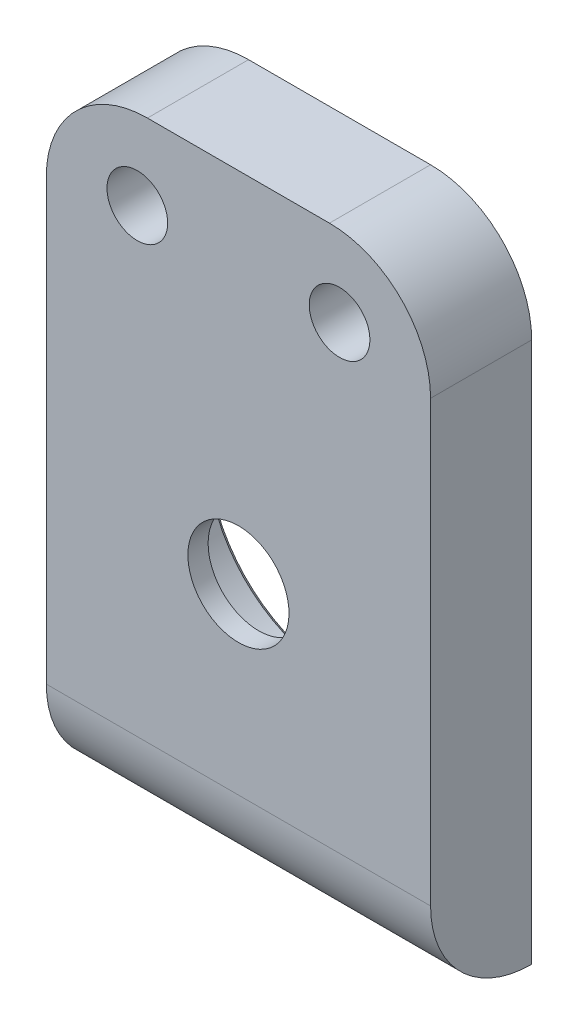
ISO-10303-21;
HEADER;
FILE_DESCRIPTION(('STEP AP214'),'2;1');
FILE_NAME('part.step','',(''),(''),'','','');
FILE_SCHEMA(('AUTOMOTIVE_DESIGN { 1 0 10303 214 1 1 1 1 }'));
ENDSEC;
DATA;
#1=APPLICATION_CONTEXT('core data for automotive mechanical design processes');
#2=APPLICATION_PROTOCOL_DEFINITION('international standard','automotive_design',2000,#1);
#3=PRODUCT_CONTEXT('',#1,'mechanical');
#4=PRODUCT('Part','Part','',(#3));
#5=PRODUCT_RELATED_PRODUCT_CATEGORY('part','',(#4));
#6=PRODUCT_DEFINITION_FORMATION('','',#4);
#7=PRODUCT_DEFINITION_CONTEXT('part definition',#1,'design');
#8=PRODUCT_DEFINITION('design','',#6,#7);
#9=PRODUCT_DEFINITION_SHAPE('','',#8);
#10=(LENGTH_UNIT() NAMED_UNIT(*) SI_UNIT(.MILLI.,.METRE.));
#11=(NAMED_UNIT(*) PLANE_ANGLE_UNIT() SI_UNIT($,.RADIAN.));
#12=(NAMED_UNIT(*) SI_UNIT($,.STERADIAN.) SOLID_ANGLE_UNIT());
#13=UNCERTAINTY_MEASURE_WITH_UNIT(LENGTH_MEASURE(1.E-05),#10,'distance_accuracy_value','');
#14=(GEOMETRIC_REPRESENTATION_CONTEXT(3) GLOBAL_UNCERTAINTY_ASSIGNED_CONTEXT((#13)) GLOBAL_UNIT_ASSIGNED_CONTEXT((#10,
#11,#12)) REPRESENTATION_CONTEXT('',''));
#15=CARTESIAN_POINT('',(0.,0.,0.));
#16=DIRECTION('',(0.,0.,1.));
#17=DIRECTION('',(1.,0.,0.));
#18=AXIS2_PLACEMENT_3D('',#15,#16,#17);
#19=CARTESIAN_POINT('',(0.,13.1015537091819,20.7143094769658));
#20=DIRECTION('',(0.,0.,-1.));
#21=DIRECTION('',(-1.,0.,0.));
#22=AXIS2_PLACEMENT_3D('',#19,#20,#21);
#23=CONICAL_SURFACE('',#22,6.,0.785398163397448);
#24=CARTESIAN_POINT('',(0.,13.1015537091819,20.2143094769658));
#25=DIRECTION('',(0.,0.,1.));
#26=DIRECTION('',(-1.,0.,0.));
#27=AXIS2_PLACEMENT_3D('',#24,#25,#26);
#28=CIRCLE('',#27,6.5);
#29=CARTESIAN_POINT('',(-6.5,13.1015537091819,20.2143094769658));
#30=VERTEX_POINT('',#29);
#31=EDGE_CURVE('E148',#30,#30,#28,.T.);
#32=ORIENTED_EDGE('',*,*,#31,.F.);
#33=EDGE_LOOP('',(#32));
#34=FACE_BOUND('',#33,.T.);
#35=CARTESIAN_POINT('',(0.,13.1015537091819,20.4643094769658));
#36=DIRECTION('',(0.,0.,-1.));
#37=DIRECTION('',(-1.,0.,0.));
#38=AXIS2_PLACEMENT_3D('',#35,#36,#37);
#39=CIRCLE('',#38,6.25);
#40=CARTESIAN_POINT('',(-6.25,13.1015537091819,20.4643094769658));
#41=VERTEX_POINT('',#40);
#42=EDGE_CURVE('E128',#41,#41,#39,.T.);
#43=ORIENTED_EDGE('',*,*,#42,.F.);
#44=EDGE_LOOP('',(#43));
#45=FACE_BOUND('',#44,.T.);
#46=ADVANCED_FACE('F43',(#34,#45),#23,.F.);
#47=CARTESIAN_POINT('',(9.5,7.60659887027264,25.2143094769657));
#48=DIRECTION('',(0.,0.,-1.));
#49=DIRECTION('',(-1.,0.,0.));
#50=AXIS2_PLACEMENT_3D('',#47,#48,#49);
#51=PLANE('',#50);
#52=CARTESIAN_POINT('',(-5.,26.8080822959938,25.2143094769657));
#53=DIRECTION('',(0.,0.,1.));
#54=DIRECTION('',(1.,0.,0.));
#55=AXIS2_PLACEMENT_3D('',#52,#53,#54);
#56=CIRCLE('',#55,1.5);
#57=CARTESIAN_POINT('',(-3.5,26.8080822959938,25.2143094769657));
#58=VERTEX_POINT('',#57);
#59=EDGE_CURVE('E127',#58,#58,#56,.T.);
#60=ORIENTED_EDGE('',*,*,#59,.F.);
#61=EDGE_LOOP('',(#60));
#62=FACE_BOUND('',#61,.T.);
#63=CARTESIAN_POINT('',(5.,26.8080822959938,25.2143094769657));
#64=DIRECTION('',(0.,0.,1.));
#65=DIRECTION('',(1.,0.,0.));
#66=AXIS2_PLACEMENT_3D('',#63,#64,#65);
#67=CIRCLE('',#66,1.5);
#68=CARTESIAN_POINT('',(6.5,26.8080822959938,25.2143094769657));
#69=VERTEX_POINT('',#68);
#70=EDGE_CURVE('E168',#69,#69,#67,.T.);
#71=ORIENTED_EDGE('',*,*,#70,.F.);
#72=EDGE_LOOP('',(#71));
#73=FACE_BOUND('',#72,.T.);
#74=CARTESIAN_POINT('',(0.,13.1015537091819,25.2143094769657));
#75=DIRECTION('',(0.,0.,-1.));
#76=DIRECTION('',(0.,1.,0.));
#77=AXIS2_PLACEMENT_3D('',#74,#75,#76);
#78=CIRCLE('',#77,2.5);
#79=CARTESIAN_POINT('',(0.,15.6015537091819,25.2143094769657));
#80=VERTEX_POINT('',#79);
#81=EDGE_CURVE('E116',#80,#80,#78,.T.);
#82=ORIENTED_EDGE('',*,*,#81,.T.);
#83=EDGE_LOOP('',(#82));
#84=FACE_BOUND('',#83,.T.);
#85=DIRECTION('',(0.,-1.,0.));
#86=VECTOR('',#85,1.);
#87=CARTESIAN_POINT('',(-9.5,7.60659887027264,25.2143094769657));
#88=LINE('',#87,#86);
#89=CARTESIAN_POINT('',(-9.5,25.8080822959938,25.2143094769657));
#90=VERTEX_POINT('',#89);
#91=CARTESIAN_POINT('',(-9.5,4.06933743514415,25.2143094769657));
#92=VERTEX_POINT('',#91);
#93=EDGE_CURVE('E153',#90,#92,#88,.T.);
#94=ORIENTED_EDGE('',*,*,#93,.T.);
#95=DIRECTION('',(-1.,0.,0.));
#96=VECTOR('',#95,1.);
#97=CARTESIAN_POINT('',(9.5,4.06933743514415,25.2143094769657));
#98=LINE('',#97,#96);
#99=CARTESIAN_POINT('',(9.5,4.06933743514415,25.2143094769657));
#100=VERTEX_POINT('',#99);
#101=EDGE_CURVE('E51',#92,#100,#98,.F.);
#102=ORIENTED_EDGE('',*,*,#101,.T.);
#103=DIRECTION('',(0.,-1.,0.));
#104=VECTOR('',#103,1.);
#105=CARTESIAN_POINT('',(9.5,7.60659887027264,25.2143094769657));
#106=LINE('',#105,#104);
#107=CARTESIAN_POINT('',(9.5,25.8080822959938,25.2143094769657));
#108=VERTEX_POINT('',#107);
#109=EDGE_CURVE('E158',#108,#100,#106,.T.);
#110=ORIENTED_EDGE('',*,*,#109,.F.);
#111=CARTESIAN_POINT('',(4.5,25.8080822959938,25.2143094769657));
#112=DIRECTION('',(0.,0.,1.));
#113=DIRECTION('',(0.,1.,0.));
#114=AXIS2_PLACEMENT_3D('',#111,#112,#113);
#115=CIRCLE('',#114,5.);
#116=CARTESIAN_POINT('',(4.5,30.8080822959938,25.2143094769657));
#117=VERTEX_POINT('',#116);
#118=EDGE_CURVE('E150',#108,#117,#115,.T.);
#119=ORIENTED_EDGE('',*,*,#118,.T.);
#120=DIRECTION('',(-1.,0.,0.));
#121=VECTOR('',#120,1.);
#122=CARTESIAN_POINT('',(9.5,30.8080822959938,25.2143094769657));
#123=LINE('',#122,#121);
#124=CARTESIAN_POINT('',(-4.5,30.8080822959938,25.2143094769657));
#125=VERTEX_POINT('',#124);
#126=EDGE_CURVE('E143',#117,#125,#123,.T.);
#127=ORIENTED_EDGE('',*,*,#126,.T.);
#128=CARTESIAN_POINT('',(-4.5,25.8080822959938,25.2143094769657));
#129=DIRECTION('',(0.,0.,1.));
#130=DIRECTION('',(0.,1.,0.));
#131=AXIS2_PLACEMENT_3D('',#128,#129,#130);
#132=CIRCLE('',#131,5.);
#133=EDGE_CURVE('E146',#125,#90,#132,.T.);
#134=ORIENTED_EDGE('',*,*,#133,.T.);
#135=EDGE_LOOP('',(#94,#102,#110,#119,#127,#134));
#136=FACE_BOUND('',#135,.T.);
#137=ADVANCED_FACE('F176',(#62,#73,#84,#136),#51,.F.);
#138=CARTESIAN_POINT('',(9.5,7.91732382523638,20.2143094769658));
#139=DIRECTION('',(0.,0.,-1.));
#140=DIRECTION('',(0.,-1.,0.));
#141=AXIS2_PLACEMENT_3D('',#138,#139,#140);
#142=PLANE('',#141);
#143=ORIENTED_EDGE('',*,*,#31,.T.);
#144=EDGE_LOOP('',(#143));
#145=FACE_BOUND('',#144,.T.);
#146=CARTESIAN_POINT('',(-5.,26.8080822959938,20.2143094769658));
#147=DIRECTION('',(0.,0.,-1.));
#148=DIRECTION('',(-1.,0.,0.));
#149=AXIS2_PLACEMENT_3D('',#146,#147,#148);
#150=CIRCLE('',#149,1.5);
#151=CARTESIAN_POINT('',(-6.5,26.8080822959938,20.2143094769658));
#152=VERTEX_POINT('',#151);
#153=EDGE_CURVE('E120',#152,#152,#150,.T.);
#154=ORIENTED_EDGE('',*,*,#153,.F.);
#155=EDGE_LOOP('',(#154));
#156=FACE_BOUND('',#155,.T.);
#157=CARTESIAN_POINT('',(5.,26.8080822959938,20.2143094769658));
#158=DIRECTION('',(0.,0.,-1.));
#159=DIRECTION('',(-1.,0.,0.));
#160=AXIS2_PLACEMENT_3D('',#157,#158,#159);
#161=CIRCLE('',#160,1.5);
#162=CARTESIAN_POINT('',(3.5,26.8080822959938,20.2143094769658));
#163=VERTEX_POINT('',#162);
#164=EDGE_CURVE('E124',#163,#163,#161,.T.);
#165=ORIENTED_EDGE('',*,*,#164,.F.);
#166=EDGE_LOOP('',(#165));
#167=FACE_BOUND('',#166,.T.);
#168=DIRECTION('',(0.,-1.,0.));
#169=VECTOR('',#168,1.);
#170=CARTESIAN_POINT('',(9.5,7.91732382523638,20.2143094769658));
#171=LINE('',#170,#169);
#172=CARTESIAN_POINT('',(9.5,25.8080822959938,20.2143094769658));
#173=VERTEX_POINT('',#172);
#174=CARTESIAN_POINT('',(9.5,-0.930662564855851,20.2143094769657));
#175=VERTEX_POINT('',#174);
#176=EDGE_CURVE('E113',#173,#175,#171,.T.);
#177=ORIENTED_EDGE('',*,*,#176,.T.);
#178=DIRECTION('',(-1.,0.,0.));
#179=VECTOR('',#178,1.);
#180=CARTESIAN_POINT('',(-9.5,-0.930662564855851,20.2143094769657));
#181=LINE('',#180,#179);
#182=CARTESIAN_POINT('',(-9.5,-0.930662564855851,20.2143094769658));
#183=VERTEX_POINT('',#182);
#184=EDGE_CURVE('E110',#175,#183,#181,.T.);
#185=ORIENTED_EDGE('',*,*,#184,.T.);
#186=DIRECTION('',(0.,-1.,0.));
#187=VECTOR('',#186,1.);
#188=CARTESIAN_POINT('',(-9.5,7.91732382523638,20.2143094769658));
#189=LINE('',#188,#187);
#190=CARTESIAN_POINT('',(-9.5,25.8080822959938,20.2143094769658));
#191=VERTEX_POINT('',#190);
#192=EDGE_CURVE('E99',#191,#183,#189,.T.);
#193=ORIENTED_EDGE('',*,*,#192,.F.);
#194=CARTESIAN_POINT('',(-4.5,25.8080822959938,20.2143094769658));
#195=DIRECTION('',(0.,0.,-1.));
#196=DIRECTION('',(-1.,0.,0.));
#197=AXIS2_PLACEMENT_3D('',#194,#195,#196);
#198=CIRCLE('',#197,5.);
#199=CARTESIAN_POINT('',(-4.5,30.8080822959938,20.2143094769658));
#200=VERTEX_POINT('',#199);
#201=EDGE_CURVE('E139',#191,#200,#198,.T.);
#202=ORIENTED_EDGE('',*,*,#201,.T.);
#203=DIRECTION('',(-1.,0.,0.));
#204=VECTOR('',#203,1.);
#205=CARTESIAN_POINT('',(9.5,30.8080822959938,20.2143094769658));
#206=LINE('',#205,#204);
#207=CARTESIAN_POINT('',(4.5,30.8080822959938,20.2143094769658));
#208=VERTEX_POINT('',#207);
#209=EDGE_CURVE('E134',#208,#200,#206,.T.);
#210=ORIENTED_EDGE('',*,*,#209,.F.);
#211=CARTESIAN_POINT('',(4.5,25.8080822959938,20.2143094769658));
#212=DIRECTION('',(0.,0.,-1.));
#213=DIRECTION('',(-1.,0.,0.));
#214=AXIS2_PLACEMENT_3D('',#211,#212,#213);
#215=CIRCLE('',#214,5.);
#216=EDGE_CURVE('E137',#208,#173,#215,.T.);
#217=ORIENTED_EDGE('',*,*,#216,.T.);
#218=EDGE_LOOP('',(#177,#185,#193,#202,#210,#217));
#219=FACE_BOUND('',#218,.T.);
#220=ADVANCED_FACE('F111',(#145,#156,#167,#219),#142,.T.);
#221=CARTESIAN_POINT('',(9.5,30.8080822959938,22.7143094769658));
#222=DIRECTION('',(0.,1.,0.));
#223=DIRECTION('',(1.,0.,0.));
#224=AXIS2_PLACEMENT_3D('',#221,#222,#223);
#225=PLANE('',#224);
#226=ORIENTED_EDGE('',*,*,#209,.T.);
#227=DIRECTION('',(0.,0.,1.));
#228=VECTOR('',#227,1.);
#229=CARTESIAN_POINT('',(-4.5,30.8080822959938,25.2143094769657));
#230=LINE('',#229,#228);
#231=EDGE_CURVE('E131',#200,#125,#230,.T.);
#232=ORIENTED_EDGE('',*,*,#231,.T.);
#233=ORIENTED_EDGE('',*,*,#126,.F.);
#234=DIRECTION('',(0.,0.,-1.));
#235=VECTOR('',#234,1.);
#236=CARTESIAN_POINT('',(4.5,30.8080822959938,22.7143094769658));
#237=LINE('',#236,#235);
#238=EDGE_CURVE('E135',#117,#208,#237,.T.);
#239=ORIENTED_EDGE('',*,*,#238,.T.);
#240=EDGE_LOOP('',(#226,#232,#233,#239));
#241=FACE_BOUND('',#240,.T.);
#242=ADVANCED_FACE('F192',(#241),#225,.T.);
#243=CARTESIAN_POINT('',(9.5,1.73141540514422,17.5374143015117));
#244=DIRECTION('',(1.,0.,0.));
#245=DIRECTION('',(0.,1.,0.));
#246=AXIS2_PLACEMENT_3D('',#243,#244,#245);
#247=PLANE('',#246);
#248=CARTESIAN_POINT('',(9.5,4.06933743514415,20.2143094769657));
#249=DIRECTION('',(1.,0.,0.));
#250=DIRECTION('',(0.,0.,-1.));
#251=AXIS2_PLACEMENT_3D('',#248,#249,#250);
#252=CIRCLE('',#251,5.);
#253=EDGE_CURVE('E11',#100,#175,#252,.T.);
#254=ORIENTED_EDGE('',*,*,#253,.T.);
#255=ORIENTED_EDGE('',*,*,#176,.F.);
#256=DIRECTION('',(0.,0.,1.));
#257=VECTOR('',#256,1.);
#258=CARTESIAN_POINT('',(9.5,25.8080822959938,17.5374143015117));
#259=LINE('',#258,#257);
#260=EDGE_CURVE('E142',#173,#108,#259,.T.);
#261=ORIENTED_EDGE('',*,*,#260,.T.);
#262=ORIENTED_EDGE('',*,*,#109,.T.);
#263=EDGE_LOOP('',(#254,#255,#261,#262));
#264=FACE_BOUND('',#263,.T.);
#265=ADVANCED_FACE('F194',(#264),#247,.T.);
#266=CARTESIAN_POINT('',(-9.5,1.73141540514422,17.5374143015117));
#267=DIRECTION('',(1.,0.,0.));
#268=DIRECTION('',(0.,1.,0.));
#269=AXIS2_PLACEMENT_3D('',#266,#267,#268);
#270=PLANE('',#269);
#271=ORIENTED_EDGE('',*,*,#192,.T.);
#272=CARTESIAN_POINT('',(-9.5,4.06933743514415,20.2143094769657));
#273=DIRECTION('',(1.,0.,0.));
#274=DIRECTION('',(0.,0.,-1.));
#275=AXIS2_PLACEMENT_3D('',#272,#273,#274);
#276=CIRCLE('',#275,5.);
#277=EDGE_CURVE('E65',#183,#92,#276,.F.);
#278=ORIENTED_EDGE('',*,*,#277,.T.);
#279=ORIENTED_EDGE('',*,*,#93,.F.);
#280=DIRECTION('',(0.,0.,-1.));
#281=VECTOR('',#280,1.);
#282=CARTESIAN_POINT('',(-9.5,25.8080822959938,20.2143094769658));
#283=LINE('',#282,#281);
#284=EDGE_CURVE('E103',#90,#191,#283,.T.);
#285=ORIENTED_EDGE('',*,*,#284,.T.);
#286=EDGE_LOOP('',(#271,#278,#279,#285));
#287=FACE_BOUND('',#286,.T.);
#288=ADVANCED_FACE('F101',(#287),#270,.F.);
#289=CARTESIAN_POINT('',(-4.5,25.8080822959938,17.5374143015117));
#290=DIRECTION('',(0.,0.,1.));
#291=DIRECTION('',(1.,0.,0.));
#292=AXIS2_PLACEMENT_3D('',#289,#290,#291);
#293=CYLINDRICAL_SURFACE('',#292,5.);
#294=ORIENTED_EDGE('',*,*,#133,.F.);
#295=ORIENTED_EDGE('',*,*,#231,.F.);
#296=ORIENTED_EDGE('',*,*,#201,.F.);
#297=ORIENTED_EDGE('',*,*,#284,.F.);
#298=EDGE_LOOP('',(#294,#295,#296,#297));
#299=FACE_BOUND('',#298,.T.);
#300=ADVANCED_FACE('F184',(#299),#293,.T.);
#301=CARTESIAN_POINT('',(4.5,25.8080822959938,22.7143094769658));
#302=DIRECTION('',(0.,0.,-1.));
#303=DIRECTION('',(-1.,0.,0.));
#304=AXIS2_PLACEMENT_3D('',#301,#302,#303);
#305=CYLINDRICAL_SURFACE('',#304,5.);
#306=ORIENTED_EDGE('',*,*,#118,.F.);
#307=ORIENTED_EDGE('',*,*,#260,.F.);
#308=ORIENTED_EDGE('',*,*,#216,.F.);
#309=ORIENTED_EDGE('',*,*,#238,.F.);
#310=EDGE_LOOP('',(#306,#307,#308,#309));
#311=FACE_BOUND('',#310,.T.);
#312=ADVANCED_FACE('F191',(#311),#305,.T.);
#313=CARTESIAN_POINT('',(0.,13.1015537091819,16.5143094769657));
#314=DIRECTION('',(0.,0.,1.));
#315=DIRECTION('',(1.,0.,0.));
#316=AXIS2_PLACEMENT_3D('',#313,#314,#315);
#317=CYLINDRICAL_SURFACE('',#316,2.5);
#318=ORIENTED_EDGE('',*,*,#81,.F.);
#319=EDGE_LOOP('',(#318));
#320=FACE_BOUND('',#319,.T.);
#321=CARTESIAN_POINT('',(0.,13.1015537091819,24.2143094769658));
#322=DIRECTION('',(0.,0.,-1.));
#323=DIRECTION('',(-1.,0.,0.));
#324=AXIS2_PLACEMENT_3D('',#321,#322,#323);
#325=CIRCLE('',#324,2.5);
#326=CARTESIAN_POINT('',(-2.5,13.1015537091819,24.2143094769658));
#327=VERTEX_POINT('',#326);
#328=EDGE_CURVE('E107',#327,#327,#325,.T.);
#329=ORIENTED_EDGE('',*,*,#328,.T.);
#330=EDGE_LOOP('',(#329));
#331=FACE_BOUND('',#330,.T.);
#332=ADVANCED_FACE('F215',(#320,#331),#317,.F.);
#333=CARTESIAN_POINT('',(0.,13.1015537091819,24.2143094769658));
#334=DIRECTION('',(0.,0.,-1.));
#335=DIRECTION('',(-1.,0.,0.));
#336=AXIS2_PLACEMENT_3D('',#333,#334,#335);
#337=PLANE('',#336);
#338=ORIENTED_EDGE('',*,*,#328,.F.);
#339=EDGE_LOOP('',(#338));
#340=FACE_BOUND('',#339,.T.);
#341=CARTESIAN_POINT('',(0.,13.1015537091819,24.2143094769658));
#342=DIRECTION('',(0.,0.,-1.));
#343=DIRECTION('',(-1.,0.,0.));
#344=AXIS2_PLACEMENT_3D('',#341,#342,#343);
#345=CIRCLE('',#344,6.25);
#346=CARTESIAN_POINT('',(-6.25,13.1015537091819,24.2143094769658));
#347=VERTEX_POINT('',#346);
#348=EDGE_CURVE('E123',#347,#347,#345,.T.);
#349=ORIENTED_EDGE('',*,*,#348,.T.);
#350=EDGE_LOOP('',(#349));
#351=FACE_BOUND('',#350,.T.);
#352=ADVANCED_FACE('F224',(#340,#351),#337,.T.);
#353=CARTESIAN_POINT('',(0.,13.1015537091819,9.8605191260576));
#354=DIRECTION('',(0.,0.,1.));
#355=DIRECTION('',(1.,0.,0.));
#356=AXIS2_PLACEMENT_3D('',#353,#354,#355);
#357=CYLINDRICAL_SURFACE('',#356,6.25);
#358=ORIENTED_EDGE('',*,*,#348,.F.);
#359=EDGE_LOOP('',(#358));
#360=FACE_BOUND('',#359,.T.);
#361=ORIENTED_EDGE('',*,*,#42,.T.);
#362=EDGE_LOOP('',(#361));
#363=FACE_BOUND('',#362,.T.);
#364=ADVANCED_FACE('F231',(#360,#363),#357,.F.);
#365=CARTESIAN_POINT('',(5.,26.8080822959938,15.2143094769657));
#366=DIRECTION('',(0.,0.,1.));
#367=DIRECTION('',(1.,0.,0.));
#368=AXIS2_PLACEMENT_3D('',#365,#366,#367);
#369=CYLINDRICAL_SURFACE('',#368,1.5);
#370=ORIENTED_EDGE('',*,*,#164,.T.);
#371=EDGE_LOOP('',(#370));
#372=FACE_BOUND('',#371,.T.);
#373=ORIENTED_EDGE('',*,*,#70,.T.);
#374=EDGE_LOOP('',(#373));
#375=FACE_BOUND('',#374,.T.);
#376=ADVANCED_FACE('F240',(#372,#375),#369,.F.);
#377=CARTESIAN_POINT('',(-5.,26.8080822959938,15.2143094769657));
#378=DIRECTION('',(0.,0.,1.));
#379=DIRECTION('',(1.,0.,0.));
#380=AXIS2_PLACEMENT_3D('',#377,#378,#379);
#381=CYLINDRICAL_SURFACE('',#380,1.5);
#382=ORIENTED_EDGE('',*,*,#153,.T.);
#383=EDGE_LOOP('',(#382));
#384=FACE_BOUND('',#383,.T.);
#385=ORIENTED_EDGE('',*,*,#59,.T.);
#386=EDGE_LOOP('',(#385));
#387=FACE_BOUND('',#386,.T.);
#388=ADVANCED_FACE('F174',(#384,#387),#381,.F.);
#389=CARTESIAN_POINT('',(0.,4.06933743514415,20.2143094769657));
#390=DIRECTION('',(1.,0.,0.));
#391=DIRECTION('',(0.,0.,-1.));
#392=AXIS2_PLACEMENT_3D('',#389,#390,#391);
#393=CYLINDRICAL_SURFACE('',#392,5.);
#394=ORIENTED_EDGE('',*,*,#253,.F.);
#395=ORIENTED_EDGE('',*,*,#101,.F.);
#396=ORIENTED_EDGE('',*,*,#277,.F.);
#397=ORIENTED_EDGE('',*,*,#184,.F.);
#398=EDGE_LOOP('',(#394,#395,#396,#397));
#399=FACE_BOUND('',#398,.T.);
#400=ADVANCED_FACE('F45',(#399),#393,.T.);
#401=CLOSED_SHELL('',(#46,#137,#220,#242,#265,#288,#300,#312,#332,#352,#364,#376,#388,#400));
#402=MANIFOLD_SOLID_BREP('B2',#401);
#403=ADVANCED_BREP_SHAPE_REPRESENTATION('',(#18,#402),#14);
#404=SHAPE_DEFINITION_REPRESENTATION(#9,#403);
ENDSEC;
END-ISO-10303-21;
